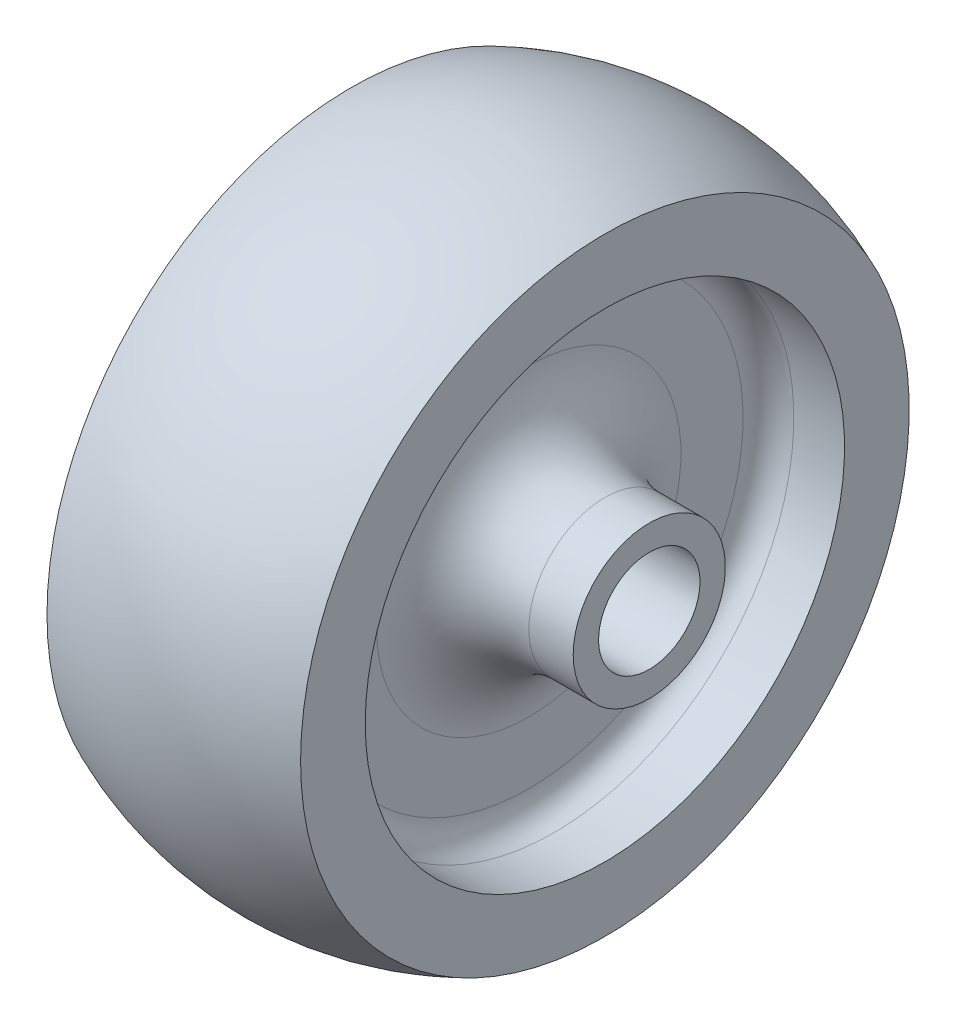
ISO-10303-21;
HEADER;
FILE_DESCRIPTION(('STEP AP214'),'2;1');
FILE_NAME('part.step','',(''),(''),'','','');
FILE_SCHEMA(('AUTOMOTIVE_DESIGN { 1 0 10303 214 1 1 1 1 }'));
ENDSEC;
DATA;
#1=APPLICATION_CONTEXT('core data for automotive mechanical design processes');
#2=APPLICATION_PROTOCOL_DEFINITION('international standard','automotive_design',2000,#1);
#3=PRODUCT_CONTEXT('',#1,'mechanical');
#4=PRODUCT('Part','Part','',(#3));
#5=PRODUCT_RELATED_PRODUCT_CATEGORY('part','',(#4));
#6=PRODUCT_DEFINITION_FORMATION('','',#4);
#7=PRODUCT_DEFINITION_CONTEXT('part definition',#1,'design');
#8=PRODUCT_DEFINITION('design','',#6,#7);
#9=PRODUCT_DEFINITION_SHAPE('','',#8);
#10=(LENGTH_UNIT() NAMED_UNIT(*) SI_UNIT(.MILLI.,.METRE.));
#11=(NAMED_UNIT(*) PLANE_ANGLE_UNIT() SI_UNIT($,.RADIAN.));
#12=(NAMED_UNIT(*) SI_UNIT($,.STERADIAN.) SOLID_ANGLE_UNIT());
#13=UNCERTAINTY_MEASURE_WITH_UNIT(LENGTH_MEASURE(1.E-05),#10,'distance_accuracy_value','');
#14=(GEOMETRIC_REPRESENTATION_CONTEXT(3) GLOBAL_UNCERTAINTY_ASSIGNED_CONTEXT((#13)) GLOBAL_UNIT_ASSIGNED_CONTEXT((#10,
#11,#12)) REPRESENTATION_CONTEXT('',''));
#15=CARTESIAN_POINT('',(0.,0.,0.));
#16=DIRECTION('',(0.,0.,1.));
#17=DIRECTION('',(1.,0.,0.));
#18=AXIS2_PLACEMENT_3D('',#15,#16,#17);
#19=CARTESIAN_POINT('',(13.5,0.,0.));
#20=DIRECTION('',(-1.,0.,0.));
#21=DIRECTION('',(0.,0.,1.));
#22=AXIS2_PLACEMENT_3D('',#19,#20,#21);
#23=DEGENERATE_TOROIDAL_SURFACE('',#22,1.0871215252208,25.,.T.);
#24=CARTESIAN_POINT('',(3.5,0.,0.));
#25=DIRECTION('',(-1.,0.,0.));
#26=DIRECTION('',(0.,0.,1.));
#27=AXIS2_PLACEMENT_3D('',#24,#25,#26);
#28=CIRCLE('',#27,24.);
#29=CARTESIAN_POINT('',(3.5,0.,24.));
#30=VERTEX_POINT('',#29);
#31=EDGE_CURVE('E85',#30,#30,#28,.T.);
#32=ORIENTED_EDGE('',*,*,#31,.F.);
#33=EDGE_LOOP('',(#32));
#34=FACE_BOUND('',#33,.T.);
#35=CARTESIAN_POINT('',(23.5,0.,0.));
#36=DIRECTION('',(-1.,0.,0.));
#37=DIRECTION('',(0.,0.,1.));
#38=AXIS2_PLACEMENT_3D('',#35,#36,#37);
#39=CIRCLE('',#38,24.);
#40=CARTESIAN_POINT('',(23.5,0.,24.));
#41=VERTEX_POINT('',#40);
#42=EDGE_CURVE('E52',#41,#41,#39,.T.);
#43=ORIENTED_EDGE('',*,*,#42,.T.);
#44=EDGE_LOOP('',(#43));
#45=FACE_BOUND('',#44,.T.);
#46=ADVANCED_FACE('F32',(#34,#45),#23,.T.);
#47=CARTESIAN_POINT('',(23.5,24.,0.));
#48=DIRECTION('',(-1.,0.,0.));
#49=DIRECTION('',(0.,0.,1.));
#50=AXIS2_PLACEMENT_3D('',#47,#48,#49);
#51=PLANE('',#50);
#52=ORIENTED_EDGE('',*,*,#42,.F.);
#53=EDGE_LOOP('',(#52));
#54=FACE_BOUND('',#53,.T.);
#55=CARTESIAN_POINT('',(23.5,0.,0.));
#56=DIRECTION('',(-1.,0.,0.));
#57=DIRECTION('',(0.,0.,1.));
#58=AXIS2_PLACEMENT_3D('',#55,#56,#57);
#59=CIRCLE('',#58,18.9);
#60=CARTESIAN_POINT('',(23.5,0.,18.9));
#61=VERTEX_POINT('',#60);
#62=EDGE_CURVE('E55',#61,#61,#59,.T.);
#63=ORIENTED_EDGE('',*,*,#62,.T.);
#64=EDGE_LOOP('',(#63));
#65=FACE_BOUND('',#64,.T.);
#66=ADVANCED_FACE('F93',(#54,#65),#51,.F.);
#67=CARTESIAN_POINT('',(0.,0.,0.));
#68=DIRECTION('',(-1.,0.,0.));
#69=DIRECTION('',(0.,0.,1.));
#70=AXIS2_PLACEMENT_3D('',#67,#68,#69);
#71=CYLINDRICAL_SURFACE('',#70,18.9);
#72=ORIENTED_EDGE('',*,*,#62,.F.);
#73=EDGE_LOOP('',(#72));
#74=FACE_BOUND('',#73,.T.);
#75=CARTESIAN_POINT('',(19.5,0.,0.));
#76=DIRECTION('',(-1.,0.,0.));
#77=DIRECTION('',(0.,0.,1.));
#78=AXIS2_PLACEMENT_3D('',#75,#76,#77);
#79=CIRCLE('',#78,18.9);
#80=CARTESIAN_POINT('',(19.5,0.,18.9));
#81=VERTEX_POINT('',#80);
#82=EDGE_CURVE('E58',#81,#81,#79,.T.);
#83=ORIENTED_EDGE('',*,*,#82,.T.);
#84=EDGE_LOOP('',(#83));
#85=FACE_BOUND('',#84,.T.);
#86=ADVANCED_FACE('F99',(#74,#85),#71,.F.);
#87=CARTESIAN_POINT('',(19.5,0.,0.));
#88=DIRECTION('',(-1.,0.,0.));
#89=DIRECTION('',(0.,0.,1.));
#90=AXIS2_PLACEMENT_3D('',#87,#88,#89);
#91=TOROIDAL_SURFACE('',#90,16.9,2.);
#92=ORIENTED_EDGE('',*,*,#82,.F.);
#93=EDGE_LOOP('',(#92));
#94=FACE_BOUND('',#93,.T.);
#95=CARTESIAN_POINT('',(17.5,0.,0.));
#96=DIRECTION('',(-1.,0.,0.));
#97=DIRECTION('',(0.,0.,1.));
#98=AXIS2_PLACEMENT_3D('',#95,#96,#97);
#99=CIRCLE('',#98,16.9);
#100=CARTESIAN_POINT('',(17.5,0.,16.9));
#101=VERTEX_POINT('',#100);
#102=EDGE_CURVE('E61',#101,#101,#99,.T.);
#103=ORIENTED_EDGE('',*,*,#102,.T.);
#104=EDGE_LOOP('',(#103));
#105=FACE_BOUND('',#104,.T.);
#106=ADVANCED_FACE('F105',(#94,#105),#91,.F.);
#107=CARTESIAN_POINT('',(17.5,6.,0.));
#108=DIRECTION('',(-1.,0.,0.));
#109=DIRECTION('',(0.,0.,1.));
#110=AXIS2_PLACEMENT_3D('',#107,#108,#109);
#111=PLANE('',#110);
#112=CARTESIAN_POINT('',(17.5,0.,0.));
#113=DIRECTION('',(-1.,0.,0.));
#114=DIRECTION('',(0.,0.,1.));
#115=AXIS2_PLACEMENT_3D('',#112,#113,#114);
#116=CIRCLE('',#115,12.);
#117=CARTESIAN_POINT('',(17.5,0.,12.));
#118=VERTEX_POINT('',#117);
#119=EDGE_CURVE('E47',#118,#118,#116,.T.);
#120=ORIENTED_EDGE('',*,*,#119,.T.);
#121=EDGE_LOOP('',(#120));
#122=FACE_BOUND('',#121,.T.);
#123=ORIENTED_EDGE('',*,*,#102,.F.);
#124=EDGE_LOOP('',(#123));
#125=FACE_BOUND('',#124,.T.);
#126=ADVANCED_FACE('F111',(#122,#125),#111,.F.);
#127=CARTESIAN_POINT('',(0.,0.,0.));
#128=DIRECTION('',(-1.,0.,0.));
#129=DIRECTION('',(0.,0.,1.));
#130=AXIS2_PLACEMENT_3D('',#127,#128,#129);
#131=CYLINDRICAL_SURFACE('',#130,6.);
#132=CARTESIAN_POINT('',(23.5,0.,0.));
#133=DIRECTION('',(-1.,0.,0.));
#134=DIRECTION('',(0.,0.,1.));
#135=AXIS2_PLACEMENT_3D('',#132,#133,#134);
#136=CIRCLE('',#135,6.);
#137=CARTESIAN_POINT('',(23.5,0.,6.));
#138=VERTEX_POINT('',#137);
#139=EDGE_CURVE('E43',#138,#138,#136,.F.);
#140=ORIENTED_EDGE('',*,*,#139,.T.);
#141=EDGE_LOOP('',(#140));
#142=FACE_BOUND('',#141,.T.);
#143=CARTESIAN_POINT('',(27.,0.,0.));
#144=DIRECTION('',(-1.,0.,0.));
#145=DIRECTION('',(0.,0.,1.));
#146=AXIS2_PLACEMENT_3D('',#143,#144,#145);
#147=CIRCLE('',#146,6.);
#148=CARTESIAN_POINT('',(27.,0.,6.));
#149=VERTEX_POINT('',#148);
#150=EDGE_CURVE('E64',#149,#149,#147,.T.);
#151=ORIENTED_EDGE('',*,*,#150,.T.);
#152=EDGE_LOOP('',(#151));
#153=FACE_BOUND('',#152,.T.);
#154=ADVANCED_FACE('F116',(#142,#153),#131,.T.);
#155=CARTESIAN_POINT('',(27.,6.,0.));
#156=DIRECTION('',(-1.,0.,0.));
#157=DIRECTION('',(0.,0.,1.));
#158=AXIS2_PLACEMENT_3D('',#155,#156,#157);
#159=PLANE('',#158);
#160=ORIENTED_EDGE('',*,*,#150,.F.);
#161=EDGE_LOOP('',(#160));
#162=FACE_BOUND('',#161,.T.);
#163=CARTESIAN_POINT('',(27.,0.,0.));
#164=DIRECTION('',(-1.,0.,0.));
#165=DIRECTION('',(0.,0.,1.));
#166=AXIS2_PLACEMENT_3D('',#163,#164,#165);
#167=CIRCLE('',#166,4.);
#168=CARTESIAN_POINT('',(27.,0.,4.));
#169=VERTEX_POINT('',#168);
#170=EDGE_CURVE('E67',#169,#169,#167,.T.);
#171=ORIENTED_EDGE('',*,*,#170,.T.);
#172=EDGE_LOOP('',(#171));
#173=FACE_BOUND('',#172,.T.);
#174=ADVANCED_FACE('F122',(#162,#173),#159,.F.);
#175=CARTESIAN_POINT('',(0.,0.,0.));
#176=DIRECTION('',(-1.,0.,0.));
#177=DIRECTION('',(0.,0.,1.));
#178=AXIS2_PLACEMENT_3D('',#175,#176,#177);
#179=CYLINDRICAL_SURFACE('',#178,4.);
#180=ORIENTED_EDGE('',*,*,#170,.F.);
#181=EDGE_LOOP('',(#180));
#182=FACE_BOUND('',#181,.T.);
#183=CARTESIAN_POINT('',(0.,0.,0.));
#184=DIRECTION('',(-1.,0.,0.));
#185=DIRECTION('',(0.,0.,1.));
#186=AXIS2_PLACEMENT_3D('',#183,#184,#185);
#187=CIRCLE('',#186,4.);
#188=CARTESIAN_POINT('',(0.,0.,4.));
#189=VERTEX_POINT('',#188);
#190=EDGE_CURVE('E70',#189,#189,#187,.T.);
#191=ORIENTED_EDGE('',*,*,#190,.T.);
#192=EDGE_LOOP('',(#191));
#193=FACE_BOUND('',#192,.T.);
#194=ADVANCED_FACE('F145',(#182,#193),#179,.F.);
#195=CARTESIAN_POINT('',(0.,4.,0.));
#196=DIRECTION('',(1.,0.,0.));
#197=DIRECTION('',(0.,0.,-1.));
#198=AXIS2_PLACEMENT_3D('',#195,#196,#197);
#199=PLANE('',#198);
#200=ORIENTED_EDGE('',*,*,#190,.F.);
#201=EDGE_LOOP('',(#200));
#202=FACE_BOUND('',#201,.T.);
#203=CARTESIAN_POINT('',(0.,0.,0.));
#204=DIRECTION('',(-1.,0.,0.));
#205=DIRECTION('',(0.,0.,1.));
#206=AXIS2_PLACEMENT_3D('',#203,#204,#205);
#207=CIRCLE('',#206,6.);
#208=CARTESIAN_POINT('',(0.,0.,6.));
#209=VERTEX_POINT('',#208);
#210=EDGE_CURVE('E73',#209,#209,#207,.T.);
#211=ORIENTED_EDGE('',*,*,#210,.T.);
#212=EDGE_LOOP('',(#211));
#213=FACE_BOUND('',#212,.T.);
#214=ADVANCED_FACE('F150',(#202,#213),#199,.F.);
#215=CARTESIAN_POINT('',(0.,0.,0.));
#216=DIRECTION('',(-1.,0.,0.));
#217=DIRECTION('',(0.,0.,1.));
#218=AXIS2_PLACEMENT_3D('',#215,#216,#217);
#219=CYLINDRICAL_SURFACE('',#218,6.);
#220=CARTESIAN_POINT('',(3.5,0.,0.));
#221=DIRECTION('',(1.,0.,0.));
#222=DIRECTION('',(0.,0.,-1.));
#223=AXIS2_PLACEMENT_3D('',#220,#221,#222);
#224=CIRCLE('',#223,6.);
#225=CARTESIAN_POINT('',(3.5,0.,-6.));
#226=VERTEX_POINT('',#225);
#227=EDGE_CURVE('E39',#226,#226,#224,.F.);
#228=ORIENTED_EDGE('',*,*,#227,.T.);
#229=EDGE_LOOP('',(#228));
#230=FACE_BOUND('',#229,.T.);
#231=ORIENTED_EDGE('',*,*,#210,.F.);
#232=EDGE_LOOP('',(#231));
#233=FACE_BOUND('',#232,.T.);
#234=ADVANCED_FACE('F156',(#230,#233),#219,.T.);
#235=CARTESIAN_POINT('',(9.5,6.,0.));
#236=DIRECTION('',(1.,0.,0.));
#237=DIRECTION('',(0.,0.,-1.));
#238=AXIS2_PLACEMENT_3D('',#235,#236,#237);
#239=PLANE('',#238);
#240=CARTESIAN_POINT('',(9.5,0.,0.));
#241=DIRECTION('',(1.,0.,0.));
#242=DIRECTION('',(0.,0.,-1.));
#243=AXIS2_PLACEMENT_3D('',#240,#241,#242);
#244=CIRCLE('',#243,12.);
#245=CARTESIAN_POINT('',(9.5,0.,-12.));
#246=VERTEX_POINT('',#245);
#247=EDGE_CURVE('E10',#246,#246,#244,.T.);
#248=ORIENTED_EDGE('',*,*,#247,.T.);
#249=EDGE_LOOP('',(#248));
#250=FACE_BOUND('',#249,.T.);
#251=CARTESIAN_POINT('',(9.5,0.,0.));
#252=DIRECTION('',(-1.,0.,0.));
#253=DIRECTION('',(0.,0.,1.));
#254=AXIS2_PLACEMENT_3D('',#251,#252,#253);
#255=CIRCLE('',#254,16.9);
#256=CARTESIAN_POINT('',(9.5,0.,16.9));
#257=VERTEX_POINT('',#256);
#258=EDGE_CURVE('E76',#257,#257,#255,.T.);
#259=ORIENTED_EDGE('',*,*,#258,.T.);
#260=EDGE_LOOP('',(#259));
#261=FACE_BOUND('',#260,.T.);
#262=ADVANCED_FACE('F161',(#250,#261),#239,.F.);
#263=CARTESIAN_POINT('',(7.5,0.,0.));
#264=DIRECTION('',(-1.,0.,0.));
#265=DIRECTION('',(0.,0.,1.));
#266=AXIS2_PLACEMENT_3D('',#263,#264,#265);
#267=TOROIDAL_SURFACE('',#266,16.9,2.);
#268=ORIENTED_EDGE('',*,*,#258,.F.);
#269=EDGE_LOOP('',(#268));
#270=FACE_BOUND('',#269,.T.);
#271=CARTESIAN_POINT('',(7.5,0.,0.));
#272=DIRECTION('',(-1.,0.,0.));
#273=DIRECTION('',(0.,0.,1.));
#274=AXIS2_PLACEMENT_3D('',#271,#272,#273);
#275=CIRCLE('',#274,18.9);
#276=CARTESIAN_POINT('',(7.5,0.,18.9));
#277=VERTEX_POINT('',#276);
#278=EDGE_CURVE('E79',#277,#277,#275,.T.);
#279=ORIENTED_EDGE('',*,*,#278,.T.);
#280=EDGE_LOOP('',(#279));
#281=FACE_BOUND('',#280,.T.);
#282=ADVANCED_FACE('F166',(#270,#281),#267,.F.);
#283=CARTESIAN_POINT('',(0.,0.,0.));
#284=DIRECTION('',(-1.,0.,0.));
#285=DIRECTION('',(0.,0.,1.));
#286=AXIS2_PLACEMENT_3D('',#283,#284,#285);
#287=CYLINDRICAL_SURFACE('',#286,18.9);
#288=ORIENTED_EDGE('',*,*,#278,.F.);
#289=EDGE_LOOP('',(#288));
#290=FACE_BOUND('',#289,.T.);
#291=CARTESIAN_POINT('',(3.5,0.,0.));
#292=DIRECTION('',(-1.,0.,0.));
#293=DIRECTION('',(0.,0.,1.));
#294=AXIS2_PLACEMENT_3D('',#291,#292,#293);
#295=CIRCLE('',#294,18.9);
#296=CARTESIAN_POINT('',(3.5,0.,18.9));
#297=VERTEX_POINT('',#296);
#298=EDGE_CURVE('E82',#297,#297,#295,.T.);
#299=ORIENTED_EDGE('',*,*,#298,.T.);
#300=EDGE_LOOP('',(#299));
#301=FACE_BOUND('',#300,.T.);
#302=ADVANCED_FACE('F134',(#290,#301),#287,.F.);
#303=CARTESIAN_POINT('',(3.5,18.9,0.));
#304=DIRECTION('',(1.,0.,0.));
#305=DIRECTION('',(0.,0.,-1.));
#306=AXIS2_PLACEMENT_3D('',#303,#304,#305);
#307=PLANE('',#306);
#308=ORIENTED_EDGE('',*,*,#298,.F.);
#309=EDGE_LOOP('',(#308));
#310=FACE_BOUND('',#309,.T.);
#311=ORIENTED_EDGE('',*,*,#31,.T.);
#312=EDGE_LOOP('',(#311));
#313=FACE_BOUND('',#312,.T.);
#314=ADVANCED_FACE('F89',(#310,#313),#307,.F.);
#315=CARTESIAN_POINT('',(23.5,0.,0.));
#316=DIRECTION('',(-1.,0.,0.));
#317=DIRECTION('',(0.,0.,1.));
#318=AXIS2_PLACEMENT_3D('',#315,#316,#317);
#319=TOROIDAL_SURFACE('',#318,12.,6.);
#320=ORIENTED_EDGE('',*,*,#139,.F.);
#321=EDGE_LOOP('',(#320));
#322=FACE_BOUND('',#321,.T.);
#323=ORIENTED_EDGE('',*,*,#119,.F.);
#324=EDGE_LOOP('',(#323));
#325=FACE_BOUND('',#324,.T.);
#326=ADVANCED_FACE('F126',(#322,#325),#319,.F.);
#327=CARTESIAN_POINT('',(3.5,0.,0.));
#328=DIRECTION('',(1.,0.,0.));
#329=DIRECTION('',(0.,0.,-1.));
#330=AXIS2_PLACEMENT_3D('',#327,#328,#329);
#331=TOROIDAL_SURFACE('',#330,12.,6.);
#332=ORIENTED_EDGE('',*,*,#247,.F.);
#333=EDGE_LOOP('',(#332));
#334=FACE_BOUND('',#333,.T.);
#335=ORIENTED_EDGE('',*,*,#227,.F.);
#336=EDGE_LOOP('',(#335));
#337=FACE_BOUND('',#336,.T.);
#338=ADVANCED_FACE('F34',(#334,#337),#331,.F.);
#339=CLOSED_SHELL('',(#46,#66,#86,#106,#126,#154,#174,#194,#214,#234,#262,#282,#302,#314,#326,#338));
#340=MANIFOLD_SOLID_BREP('B2',#339);
#341=ADVANCED_BREP_SHAPE_REPRESENTATION('',(#18,#340),#14);
#342=SHAPE_DEFINITION_REPRESENTATION(#9,#341);
ENDSEC;
END-ISO-10303-21;
